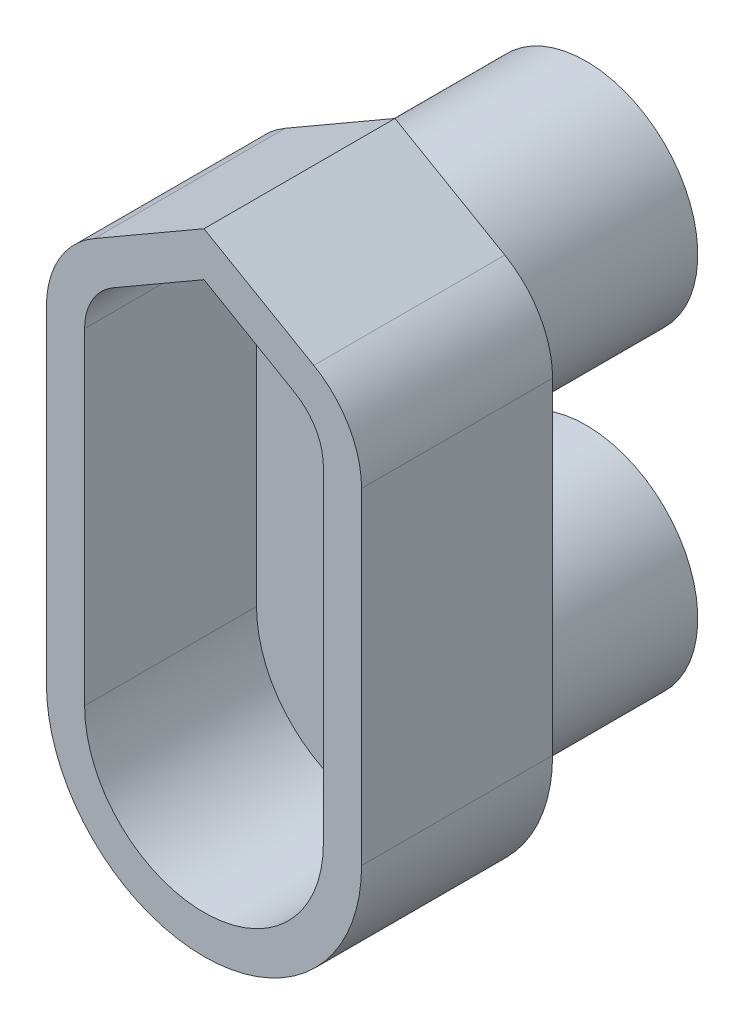
ISO-10303-21;
HEADER;
FILE_DESCRIPTION(('STEP AP214'),'2;1');
FILE_NAME('part.step','',(''),(''),'','','');
FILE_SCHEMA(('AUTOMOTIVE_DESIGN { 1 0 10303 214 1 1 1 1 }'));
ENDSEC;
DATA;
#1=APPLICATION_CONTEXT('core data for automotive mechanical design processes');
#2=APPLICATION_PROTOCOL_DEFINITION('international standard','automotive_design',2000,#1);
#3=PRODUCT_CONTEXT('',#1,'mechanical');
#4=PRODUCT('Part','Part','',(#3));
#5=PRODUCT_RELATED_PRODUCT_CATEGORY('part','',(#4));
#6=PRODUCT_DEFINITION_FORMATION('','',#4);
#7=PRODUCT_DEFINITION_CONTEXT('part definition',#1,'design');
#8=PRODUCT_DEFINITION('design','',#6,#7);
#9=PRODUCT_DEFINITION_SHAPE('','',#8);
#10=(LENGTH_UNIT() NAMED_UNIT(*) SI_UNIT(.MILLI.,.METRE.));
#11=(NAMED_UNIT(*) PLANE_ANGLE_UNIT() SI_UNIT($,.RADIAN.));
#12=(NAMED_UNIT(*) SI_UNIT($,.STERADIAN.) SOLID_ANGLE_UNIT());
#13=UNCERTAINTY_MEASURE_WITH_UNIT(LENGTH_MEASURE(1.E-05),#10,'distance_accuracy_value','');
#14=(GEOMETRIC_REPRESENTATION_CONTEXT(3) GLOBAL_UNCERTAINTY_ASSIGNED_CONTEXT((#13)) GLOBAL_UNIT_ASSIGNED_CONTEXT((#10,
#11,#12)) REPRESENTATION_CONTEXT('',''));
#15=CARTESIAN_POINT('',(0.,0.,0.));
#16=DIRECTION('',(0.,0.,1.));
#17=DIRECTION('',(1.,0.,0.));
#18=AXIS2_PLACEMENT_3D('',#15,#16,#17);
#19=CARTESIAN_POINT('',(-26.8644378136444,165.,20.));
#20=DIRECTION('',(1.,0.,0.));
#21=DIRECTION('',(0.,1.,0.));
#22=AXIS2_PLACEMENT_3D('',#19,#20,#21);
#23=PLANE('',#22);
#24=DIRECTION('',(0.,-1.,0.));
#25=VECTOR('',#24,1.);
#26=CARTESIAN_POINT('',(-26.8644378136444,165.,20.));
#27=LINE('',#26,#25);
#28=CARTESIAN_POINT('',(-26.8644378136444,157.350108933237,20.));
#29=VERTEX_POINT('',#28);
#30=CARTESIAN_POINT('',(-26.8644378136444,140.25,20.));
#31=VERTEX_POINT('',#30);
#32=EDGE_CURVE('E302',#29,#31,#27,.T.);
#33=ORIENTED_EDGE('',*,*,#32,.F.);
#34=DIRECTION('',(0.,0.,1.));
#35=VECTOR('',#34,1.);
#36=CARTESIAN_POINT('',(-26.8644378136444,157.350108933237,10.));
#37=LINE('',#36,#35);
#38=CARTESIAN_POINT('',(-26.8644378136444,157.350108933237,10.));
#39=VERTEX_POINT('',#38);
#40=EDGE_CURVE('E358',#29,#39,#37,.F.);
#41=ORIENTED_EDGE('',*,*,#40,.T.);
#42=DIRECTION('',(0.,1.,0.));
#43=VECTOR('',#42,1.);
#44=CARTESIAN_POINT('',(-26.8644378136444,0.,10.));
#45=LINE('',#44,#43);
#46=CARTESIAN_POINT('',(-26.8644378136444,140.25,10.));
#47=VERTEX_POINT('',#46);
#48=EDGE_CURVE('E264',#47,#39,#45,.T.);
#49=ORIENTED_EDGE('',*,*,#48,.F.);
#50=DIRECTION('',(0.,0.,-1.));
#51=VECTOR('',#50,1.);
#52=CARTESIAN_POINT('',(-26.8644378136444,140.25,20.));
#53=LINE('',#52,#51);
#54=EDGE_CURVE('E310',#47,#31,#53,.F.);
#55=ORIENTED_EDGE('',*,*,#54,.T.);
#56=EDGE_LOOP('',(#33,#41,#49,#55));
#57=FACE_BOUND('',#56,.T.);
#58=ADVANCED_FACE('F71',(#57),#23,.F.);
#59=CARTESIAN_POINT('',(-10.3644378136444,165.,20.));
#60=DIRECTION('',(-1.,0.,0.));
#61=DIRECTION('',(0.,-1.,0.));
#62=AXIS2_PLACEMENT_3D('',#59,#60,#61);
#63=PLANE('',#62);
#64=DIRECTION('',(0.,-1.,0.));
#65=VECTOR('',#64,1.);
#66=CARTESIAN_POINT('',(-10.3644378136444,0.,10.));
#67=LINE('',#66,#65);
#68=CARTESIAN_POINT('',(-10.3644378136444,157.350108933237,10.));
#69=VERTEX_POINT('',#68);
#70=CARTESIAN_POINT('',(-10.3644378136444,140.25,10.));
#71=VERTEX_POINT('',#70);
#72=EDGE_CURVE('E267',#69,#71,#67,.T.);
#73=ORIENTED_EDGE('',*,*,#72,.F.);
#74=DIRECTION('',(0.,0.,-1.));
#75=VECTOR('',#74,1.);
#76=CARTESIAN_POINT('',(-10.3644378136444,157.350108933237,20.));
#77=LINE('',#76,#75);
#78=CARTESIAN_POINT('',(-10.3644378136444,157.350108933237,20.));
#79=VERTEX_POINT('',#78);
#80=EDGE_CURVE('E340',#69,#79,#77,.F.);
#81=ORIENTED_EDGE('',*,*,#80,.T.);
#82=DIRECTION('',(0.,1.,0.));
#83=VECTOR('',#82,1.);
#84=CARTESIAN_POINT('',(-10.3644378136444,165.,20.));
#85=LINE('',#84,#83);
#86=CARTESIAN_POINT('',(-10.3644378136444,140.25,20.));
#87=VERTEX_POINT('',#86);
#88=EDGE_CURVE('E305',#87,#79,#85,.T.);
#89=ORIENTED_EDGE('',*,*,#88,.F.);
#90=DIRECTION('',(0.,0.,-1.));
#91=VECTOR('',#90,1.);
#92=CARTESIAN_POINT('',(-10.3644378136444,140.25,20.));
#93=LINE('',#92,#91);
#94=EDGE_CURVE('E321',#87,#71,#93,.T.);
#95=ORIENTED_EDGE('',*,*,#94,.T.);
#96=EDGE_LOOP('',(#73,#81,#89,#95));
#97=FACE_BOUND('',#96,.T.);
#98=ADVANCED_FACE('F384',(#97),#63,.F.);
#99=CARTESIAN_POINT('',(-18.6144378136444,140.25,20.));
#100=DIRECTION('',(0.,0.,-1.));
#101=DIRECTION('',(-1.,0.,0.));
#102=AXIS2_PLACEMENT_3D('',#99,#100,#101);
#103=CYLINDRICAL_SURFACE('',#102,8.25);
#104=DIRECTION('',(0.,0.,-1.));
#105=VECTOR('',#104,1.);
#106=CARTESIAN_POINT('',(-18.6144378136444,132.,20.));
#107=LINE('',#106,#105);
#108=CARTESIAN_POINT('',(-18.6144378136444,132.,10.));
#109=VERTEX_POINT('',#108);
#110=CARTESIAN_POINT('',(-18.6144378136444,132.,20.));
#111=VERTEX_POINT('',#110);
#112=EDGE_CURVE('E306',#109,#111,#107,.F.);
#113=ORIENTED_EDGE('',*,*,#112,.F.);
#114=CARTESIAN_POINT('',(-18.6144378136444,140.25,10.));
#115=DIRECTION('',(0.,0.,-1.));
#116=DIRECTION('',(-1.,0.,0.));
#117=AXIS2_PLACEMENT_3D('',#114,#115,#116);
#118=CIRCLE('',#117,8.25);
#119=EDGE_CURVE('E272',#71,#109,#118,.T.);
#120=ORIENTED_EDGE('',*,*,#119,.F.);
#121=ORIENTED_EDGE('',*,*,#94,.F.);
#122=CARTESIAN_POINT('',(-18.6144378136444,140.25,20.));
#123=DIRECTION('',(0.,0.,1.));
#124=DIRECTION('',(1.,0.,0.));
#125=AXIS2_PLACEMENT_3D('',#122,#123,#124);
#126=CIRCLE('',#125,8.25);
#127=EDGE_CURVE('E314',#111,#87,#126,.T.);
#128=ORIENTED_EDGE('',*,*,#127,.F.);
#129=EDGE_LOOP('',(#113,#120,#121,#128));
#130=FACE_BOUND('',#129,.T.);
#131=ADVANCED_FACE('F390',(#130),#103,.T.);
#132=CARTESIAN_POINT('',(-18.6144378136444,140.25,20.));
#133=DIRECTION('',(0.,0.,-1.));
#134=DIRECTION('',(-1.,0.,0.));
#135=AXIS2_PLACEMENT_3D('',#132,#133,#134);
#136=CYLINDRICAL_SURFACE('',#135,8.25);
#137=ORIENTED_EDGE('',*,*,#54,.F.);
#138=EDGE_CURVE('E271',#109,#47,#118,.T.);
#139=ORIENTED_EDGE('',*,*,#138,.F.);
#140=ORIENTED_EDGE('',*,*,#112,.T.);
#141=CARTESIAN_POINT('',(-18.6144378136444,140.25,20.));
#142=DIRECTION('',(0.,0.,1.));
#143=DIRECTION('',(1.,0.,0.));
#144=AXIS2_PLACEMENT_3D('',#141,#142,#143);
#145=CIRCLE('',#144,8.25);
#146=EDGE_CURVE('E317',#31,#111,#145,.T.);
#147=ORIENTED_EDGE('',*,*,#146,.F.);
#148=EDGE_LOOP('',(#137,#139,#140,#147));
#149=FACE_BOUND('',#148,.T.);
#150=ADVANCED_FACE('F396',(#149),#136,.T.);
#151=CARTESIAN_POINT('',(-18.6144378136445,165.,20.));
#152=DIRECTION('',(-0.499999999999997,-0.86602540378444,0.));
#153=DIRECTION('',(0.,0.,-1.));
#154=AXIS2_PLACEMENT_3D('',#151,#152,#153);
#155=PLANE('',#154);
#156=DIRECTION('',(0.86602540378444,-0.499999999999997,0.));
#157=VECTOR('',#156,1.);
#158=CARTESIAN_POINT('',(66.7934863588049,115.68971198811,20.));
#159=LINE('',#158,#157);
#160=CARTESIAN_POINT('',(-12.8644378136445,161.68023595216,20.));
#161=VERTEX_POINT('',#160);
#162=CARTESIAN_POINT('',(-18.6144378136445,165.,20.));
#163=VERTEX_POINT('',#162);
#164=EDGE_CURVE('E325',#161,#163,#159,.F.);
#165=ORIENTED_EDGE('',*,*,#164,.F.);
#166=DIRECTION('',(0.,0.,1.));
#167=VECTOR('',#166,1.);
#168=CARTESIAN_POINT('',(-12.8644378136445,161.68023595216,10.));
#169=LINE('',#168,#167);
#170=CARTESIAN_POINT('',(-12.8644378136444,161.68023595216,10.));
#171=VERTEX_POINT('',#170);
#172=EDGE_CURVE('E350',#161,#171,#169,.F.);
#173=ORIENTED_EDGE('',*,*,#172,.T.);
#174=DIRECTION('',(0.86602540378444,-0.499999999999997,0.));
#175=VECTOR('',#174,1.);
#176=CARTESIAN_POINT('',(-18.6144378136445,165.,10.));
#177=LINE('',#176,#175);
#178=CARTESIAN_POINT('',(-18.6144378136444,165.,10.));
#179=VERTEX_POINT('',#178);
#180=EDGE_CURVE('E298',#171,#179,#177,.F.);
#181=ORIENTED_EDGE('',*,*,#180,.T.);
#182=DIRECTION('',(0.,0.,-1.));
#183=VECTOR('',#182,1.);
#184=CARTESIAN_POINT('',(-18.6144378136445,165.,20.));
#185=LINE('',#184,#183);
#186=EDGE_CURVE('E301',#163,#179,#185,.T.);
#187=ORIENTED_EDGE('',*,*,#186,.F.);
#188=EDGE_LOOP('',(#165,#173,#181,#187));
#189=FACE_BOUND('',#188,.T.);
#190=ADVANCED_FACE('F399',(#189),#155,.F.);
#191=CARTESIAN_POINT('',(-26.8644378136444,160.236860279186,20.));
#192=DIRECTION('',(0.499999999999997,-0.86602540378444,0.));
#193=DIRECTION('',(0.,0.,-1.));
#194=AXIS2_PLACEMENT_3D('',#191,#192,#193);
#195=PLANE('',#194);
#196=DIRECTION('',(0.86602540378444,0.499999999999997,0.));
#197=VECTOR('',#196,1.);
#198=CARTESIAN_POINT('',(-26.8644378136444,160.236860279186,10.));
#199=LINE('',#198,#197);
#200=CARTESIAN_POINT('',(-24.3644378136444,161.68023595216,10.));
#201=VERTEX_POINT('',#200);
#202=EDGE_CURVE('E334',#179,#201,#199,.F.);
#203=ORIENTED_EDGE('',*,*,#202,.T.);
#204=DIRECTION('',(0.,0.,-1.));
#205=VECTOR('',#204,1.);
#206=CARTESIAN_POINT('',(-24.3644378136444,161.68023595216,20.));
#207=LINE('',#206,#205);
#208=CARTESIAN_POINT('',(-24.3644378136444,161.68023595216,20.));
#209=VERTEX_POINT('',#208);
#210=EDGE_CURVE('E80',#201,#209,#207,.F.);
#211=ORIENTED_EDGE('',*,*,#210,.T.);
#212=DIRECTION('',(0.86602540378444,0.499999999999997,0.));
#213=VECTOR('',#212,1.);
#214=CARTESIAN_POINT('',(-76.100705265627,131.810288011891,20.));
#215=LINE('',#214,#213);
#216=EDGE_CURVE('E330',#163,#209,#215,.F.);
#217=ORIENTED_EDGE('',*,*,#216,.F.);
#218=ORIENTED_EDGE('',*,*,#186,.T.);
#219=EDGE_LOOP('',(#203,#211,#217,#218));
#220=FACE_BOUND('',#219,.T.);
#221=ADVANCED_FACE('F405',(#220),#195,.F.);
#222=CARTESIAN_POINT('',(0.,0.,20.));
#223=DIRECTION('',(0.,0.,1.));
#224=DIRECTION('',(1.,0.,0.));
#225=AXIS2_PLACEMENT_3D('',#222,#223,#224);
#226=PLANE('',#225);
#227=CARTESIAN_POINT('',(-18.6144378136444,140.25,20.));
#228=DIRECTION('',(0.,0.,1.));
#229=DIRECTION('',(1.,0.,0.));
#230=AXIS2_PLACEMENT_3D('',#227,#228,#229);
#231=CIRCLE('',#230,6.25);
#232=CARTESIAN_POINT('',(-24.8644378136444,140.25,20.));
#233=VERTEX_POINT('',#232);
#234=CARTESIAN_POINT('',(-12.3644378136444,140.25,20.));
#235=VERTEX_POINT('',#234);
#236=EDGE_CURVE('E184',#233,#235,#231,.T.);
#237=ORIENTED_EDGE('',*,*,#236,.F.);
#238=DIRECTION('',(0.,-1.,0.));
#239=VECTOR('',#238,1.);
#240=CARTESIAN_POINT('',(-24.8644378136444,157.350108933237,20.));
#241=LINE('',#240,#239);
#242=CARTESIAN_POINT('',(-24.8644378136445,157.350108933237,20.));
#243=VERTEX_POINT('',#242);
#244=EDGE_CURVE('E206',#243,#233,#241,.T.);
#245=ORIENTED_EDGE('',*,*,#244,.F.);
#246=CARTESIAN_POINT('',(-21.8644378136444,157.350108933237,20.));
#247=DIRECTION('',(0.,0.,1.));
#248=DIRECTION('',(1.,0.,0.));
#249=AXIS2_PLACEMENT_3D('',#246,#247,#248);
#250=CIRCLE('',#249,3.00000000000002);
#251=CARTESIAN_POINT('',(-23.3644378136444,159.948185144591,20.));
#252=VERTEX_POINT('',#251);
#253=EDGE_CURVE('E239',#252,#243,#250,.T.);
#254=ORIENTED_EDGE('',*,*,#253,.F.);
#255=DIRECTION('',(-0.866025403784438,-0.500000000000001,0.));
#256=VECTOR('',#255,1.);
#257=CARTESIAN_POINT('',(-18.6144378136445,162.690598923242,20.));
#258=LINE('',#257,#256);
#259=CARTESIAN_POINT('',(-18.6144378136445,162.690598923242,20.));
#260=VERTEX_POINT('',#259);
#261=EDGE_CURVE('E235',#260,#252,#258,.T.);
#262=ORIENTED_EDGE('',*,*,#261,.F.);
#263=DIRECTION('',(-0.866025403784441,0.499999999999995,0.));
#264=VECTOR('',#263,1.);
#265=CARTESIAN_POINT('',(-13.8644378136445,159.948185144591,20.));
#266=LINE('',#265,#264);
#267=CARTESIAN_POINT('',(-13.8644378136445,159.948185144591,20.));
#268=VERTEX_POINT('',#267);
#269=EDGE_CURVE('E231',#268,#260,#266,.T.);
#270=ORIENTED_EDGE('',*,*,#269,.F.);
#271=CARTESIAN_POINT('',(-15.3644378136444,157.350108933237,20.));
#272=DIRECTION('',(0.,0.,1.));
#273=DIRECTION('',(1.,0.,0.));
#274=AXIS2_PLACEMENT_3D('',#271,#272,#273);
#275=CIRCLE('',#274,3.);
#276=CARTESIAN_POINT('',(-12.3644378136444,157.350108933237,20.));
#277=VERTEX_POINT('',#276);
#278=EDGE_CURVE('E227',#277,#268,#275,.T.);
#279=ORIENTED_EDGE('',*,*,#278,.F.);
#280=DIRECTION('',(0.,1.,0.));
#281=VECTOR('',#280,1.);
#282=CARTESIAN_POINT('',(-12.3644378136444,140.25,20.));
#283=LINE('',#282,#281);
#284=EDGE_CURVE('E224',#235,#277,#283,.T.);
#285=ORIENTED_EDGE('',*,*,#284,.F.);
#286=EDGE_LOOP('',(#237,#245,#254,#262,#270,#279,#285));
#287=FACE_BOUND('',#286,.T.);
#288=ORIENTED_EDGE('',*,*,#88,.T.);
#289=CARTESIAN_POINT('',(-15.3644378136444,157.350108933237,20.));
#290=DIRECTION('',(0.,0.,1.));
#291=DIRECTION('',(1.,0.,0.));
#292=AXIS2_PLACEMENT_3D('',#289,#290,#291);
#293=CIRCLE('',#292,5.);
#294=EDGE_CURVE('E347',#79,#161,#293,.T.);
#295=ORIENTED_EDGE('',*,*,#294,.T.);
#296=ORIENTED_EDGE('',*,*,#164,.T.);
#297=ORIENTED_EDGE('',*,*,#216,.T.);
#298=CARTESIAN_POINT('',(-21.8644378136444,157.350108933237,20.));
#299=DIRECTION('',(0.,0.,1.));
#300=DIRECTION('',(1.,0.,0.));
#301=AXIS2_PLACEMENT_3D('',#298,#299,#300);
#302=CIRCLE('',#301,5.);
#303=EDGE_CURVE('E344',#209,#29,#302,.T.);
#304=ORIENTED_EDGE('',*,*,#303,.T.);
#305=ORIENTED_EDGE('',*,*,#32,.T.);
#306=ORIENTED_EDGE('',*,*,#146,.T.);
#307=ORIENTED_EDGE('',*,*,#127,.T.);
#308=EDGE_LOOP('',(#288,#295,#296,#297,#304,#305,#306,#307));
#309=FACE_BOUND('',#308,.T.);
#310=ADVANCED_FACE('F411',(#287,#309),#226,.T.);
#311=CARTESIAN_POINT('',(-18.6144378136445,140.25,10.));
#312=DIRECTION('',(0.,0.,-1.));
#313=DIRECTION('',(-1.,0.,0.));
#314=AXIS2_PLACEMENT_3D('',#311,#312,#313);
#315=CYLINDRICAL_SURFACE('',#314,5.84999999999999);
#316=CARTESIAN_POINT('',(-18.6144378136445,140.25,10.));
#317=DIRECTION('',(0.,0.,-1.));
#318=DIRECTION('',(-1.,0.,0.));
#319=AXIS2_PLACEMENT_3D('',#316,#317,#318);
#320=CIRCLE('',#319,5.84999999999999);
#321=CARTESIAN_POINT('',(-24.4644378136445,140.25,10.));
#322=VERTEX_POINT('',#321);
#323=EDGE_CURVE('E275',#322,#322,#320,.F.);
#324=ORIENTED_EDGE('',*,*,#323,.F.);
#325=EDGE_LOOP('',(#324));
#326=FACE_BOUND('',#325,.T.);
#327=CARTESIAN_POINT('',(-18.6144378136445,140.25,0.));
#328=DIRECTION('',(0.,0.,-1.));
#329=DIRECTION('',(-1.,0.,0.));
#330=AXIS2_PLACEMENT_3D('',#327,#328,#329);
#331=CIRCLE('',#330,5.84999999999999);
#332=CARTESIAN_POINT('',(-24.4644378136445,140.25,0.));
#333=VERTEX_POINT('',#332);
#334=EDGE_CURVE('E284',#333,#333,#331,.F.);
#335=ORIENTED_EDGE('',*,*,#334,.T.);
#336=EDGE_LOOP('',(#335));
#337=FACE_BOUND('',#336,.T.);
#338=ADVANCED_FACE('F451',(#326,#337),#315,.T.);
#339=CARTESIAN_POINT('',(-18.6144378136445,156.75,10.));
#340=DIRECTION('',(0.,0.,-1.));
#341=DIRECTION('',(-1.,0.,0.));
#342=AXIS2_PLACEMENT_3D('',#339,#340,#341);
#343=CYLINDRICAL_SURFACE('',#342,5.84999999999999);
#344=CARTESIAN_POINT('',(-18.6144378136445,156.75,10.));
#345=DIRECTION('',(0.,0.,-1.));
#346=DIRECTION('',(-1.,0.,0.));
#347=AXIS2_PLACEMENT_3D('',#344,#345,#346);
#348=CIRCLE('',#347,5.84999999999999);
#349=CARTESIAN_POINT('',(-24.4644378136445,156.75,10.));
#350=VERTEX_POINT('',#349);
#351=EDGE_CURVE('E279',#350,#350,#348,.T.);
#352=ORIENTED_EDGE('',*,*,#351,.T.);
#353=EDGE_LOOP('',(#352));
#354=FACE_BOUND('',#353,.T.);
#355=CARTESIAN_POINT('',(-18.6144378136445,156.75,0.));
#356=DIRECTION('',(0.,0.,-1.));
#357=DIRECTION('',(-1.,0.,0.));
#358=AXIS2_PLACEMENT_3D('',#355,#356,#357);
#359=CIRCLE('',#358,5.84999999999999);
#360=CARTESIAN_POINT('',(-24.4644378136445,156.75,0.));
#361=VERTEX_POINT('',#360);
#362=EDGE_CURVE('E268',#361,#361,#359,.T.);
#363=ORIENTED_EDGE('',*,*,#362,.F.);
#364=EDGE_LOOP('',(#363));
#365=FACE_BOUND('',#364,.T.);
#366=ADVANCED_FACE('F457',(#354,#365),#343,.T.);
#367=CARTESIAN_POINT('',(0.,0.,10.));
#368=DIRECTION('',(0.,0.,-1.));
#369=DIRECTION('',(-1.,0.,0.));
#370=AXIS2_PLACEMENT_3D('',#367,#368,#369);
#371=PLANE('',#370);
#372=ORIENTED_EDGE('',*,*,#180,.F.);
#373=CARTESIAN_POINT('',(-15.3644378136444,157.350108933237,10.));
#374=DIRECTION('',(0.,0.,-1.));
#375=DIRECTION('',(-1.,0.,0.));
#376=AXIS2_PLACEMENT_3D('',#373,#374,#375);
#377=CIRCLE('',#376,5.);
#378=EDGE_CURVE('E355',#171,#69,#377,.T.);
#379=ORIENTED_EDGE('',*,*,#378,.T.);
#380=ORIENTED_EDGE('',*,*,#72,.T.);
#381=ORIENTED_EDGE('',*,*,#119,.T.);
#382=ORIENTED_EDGE('',*,*,#138,.T.);
#383=ORIENTED_EDGE('',*,*,#48,.T.);
#384=CARTESIAN_POINT('',(-21.8644378136444,157.350108933237,10.));
#385=DIRECTION('',(0.,0.,-1.));
#386=DIRECTION('',(-1.,0.,0.));
#387=AXIS2_PLACEMENT_3D('',#384,#385,#386);
#388=CIRCLE('',#387,5.);
#389=EDGE_CURVE('E95',#39,#201,#388,.T.);
#390=ORIENTED_EDGE('',*,*,#389,.T.);
#391=ORIENTED_EDGE('',*,*,#202,.F.);
#392=EDGE_LOOP('',(#372,#379,#380,#381,#382,#383,#390,#391));
#393=FACE_BOUND('',#392,.T.);
#394=ORIENTED_EDGE('',*,*,#323,.T.);
#395=EDGE_LOOP('',(#394));
#396=FACE_BOUND('',#395,.T.);
#397=ORIENTED_EDGE('',*,*,#351,.F.);
#398=EDGE_LOOP('',(#397));
#399=FACE_BOUND('',#398,.T.);
#400=ADVANCED_FACE('F431',(#393,#396,#399),#371,.T.);
#401=CARTESIAN_POINT('',(0.,0.,0.));
#402=DIRECTION('',(0.,0.,1.));
#403=DIRECTION('',(1.,0.,0.));
#404=AXIS2_PLACEMENT_3D('',#401,#402,#403);
#405=PLANE('',#404);
#406=CARTESIAN_POINT('',(-18.6144378136445,156.75,0.));
#407=DIRECTION('',(0.,0.,-1.));
#408=DIRECTION('',(-1.,0.,0.));
#409=AXIS2_PLACEMENT_3D('',#406,#407,#408);
#410=CIRCLE('',#409,5.05);
#411=CARTESIAN_POINT('',(-23.6644378136445,156.75,0.));
#412=VERTEX_POINT('',#411);
#413=EDGE_CURVE('E294',#412,#412,#410,.T.);
#414=ORIENTED_EDGE('',*,*,#413,.F.);
#415=EDGE_LOOP('',(#414));
#416=FACE_BOUND('',#415,.T.);
#417=ORIENTED_EDGE('',*,*,#362,.T.);
#418=EDGE_LOOP('',(#417));
#419=FACE_BOUND('',#418,.T.);
#420=ADVANCED_FACE('F463',(#416,#419),#405,.F.);
#421=CARTESIAN_POINT('',(-18.6144378136445,156.75,10.));
#422=DIRECTION('',(0.,0.,-1.));
#423=DIRECTION('',(-1.,0.,0.));
#424=AXIS2_PLACEMENT_3D('',#421,#422,#423);
#425=CYLINDRICAL_SURFACE('',#424,5.05);
#426=CARTESIAN_POINT('',(-18.6144378136445,156.75,2.7));
#427=DIRECTION('',(0.,0.,-1.));
#428=DIRECTION('',(-1.,0.,0.));
#429=AXIS2_PLACEMENT_3D('',#426,#427,#428);
#430=CIRCLE('',#429,5.05);
#431=CARTESIAN_POINT('',(-23.6644378136445,156.75,2.7));
#432=VERTEX_POINT('',#431);
#433=EDGE_CURVE('E249',#432,#432,#430,.F.);
#434=ORIENTED_EDGE('',*,*,#433,.T.);
#435=EDGE_LOOP('',(#434));
#436=FACE_BOUND('',#435,.T.);
#437=ORIENTED_EDGE('',*,*,#413,.T.);
#438=EDGE_LOOP('',(#437));
#439=FACE_BOUND('',#438,.T.);
#440=ADVANCED_FACE('F367',(#436,#439),#425,.F.);
#441=ORIENTED_EDGE('',*,*,#334,.F.);
#442=EDGE_LOOP('',(#441));
#443=FACE_BOUND('',#442,.T.);
#444=CARTESIAN_POINT('',(-18.6144378136445,140.25,0.));
#445=DIRECTION('',(0.,0.,-1.));
#446=DIRECTION('',(-1.,0.,0.));
#447=AXIS2_PLACEMENT_3D('',#444,#445,#446);
#448=CIRCLE('',#447,5.05);
#449=CARTESIAN_POINT('',(-23.6644378136445,140.25,0.));
#450=VERTEX_POINT('',#449);
#451=EDGE_CURVE('E283',#450,#450,#448,.F.);
#452=ORIENTED_EDGE('',*,*,#451,.T.);
#453=EDGE_LOOP('',(#452));
#454=FACE_BOUND('',#453,.T.);
#455=ADVANCED_FACE('F423',(#443,#454),#405,.F.);
#456=CARTESIAN_POINT('',(-18.6144378136445,140.25,10.));
#457=DIRECTION('',(0.,0.,-1.));
#458=DIRECTION('',(-1.,0.,0.));
#459=AXIS2_PLACEMENT_3D('',#456,#457,#458);
#460=CYLINDRICAL_SURFACE('',#459,5.05);
#461=CARTESIAN_POINT('',(-18.6144378136445,140.25,2.7));
#462=DIRECTION('',(0.,0.,-1.));
#463=DIRECTION('',(-1.,0.,0.));
#464=AXIS2_PLACEMENT_3D('',#461,#462,#463);
#465=CIRCLE('',#464,5.05);
#466=CARTESIAN_POINT('',(-23.6644378136445,140.25,2.7));
#467=VERTEX_POINT('',#466);
#468=EDGE_CURVE('E12',#467,#467,#465,.T.);
#469=ORIENTED_EDGE('',*,*,#468,.F.);
#470=EDGE_LOOP('',(#469));
#471=FACE_BOUND('',#470,.T.);
#472=ORIENTED_EDGE('',*,*,#451,.F.);
#473=EDGE_LOOP('',(#472));
#474=FACE_BOUND('',#473,.T.);
#475=ADVANCED_FACE('F418',(#471,#474),#460,.F.);
#476=CARTESIAN_POINT('',(-15.3644378136444,157.350108933237,20.));
#477=DIRECTION('',(0.,0.,1.));
#478=DIRECTION('',(1.,0.,0.));
#479=AXIS2_PLACEMENT_3D('',#476,#477,#478);
#480=CYLINDRICAL_SURFACE('',#479,5.);
#481=ORIENTED_EDGE('',*,*,#378,.F.);
#482=ORIENTED_EDGE('',*,*,#172,.F.);
#483=ORIENTED_EDGE('',*,*,#294,.F.);
#484=ORIENTED_EDGE('',*,*,#80,.F.);
#485=EDGE_LOOP('',(#481,#482,#483,#484));
#486=FACE_BOUND('',#485,.T.);
#487=ADVANCED_FACE('F380',(#486),#480,.T.);
#488=CARTESIAN_POINT('',(-21.8644378136444,157.350108933237,20.));
#489=DIRECTION('',(0.,0.,-1.));
#490=DIRECTION('',(-1.,0.,0.));
#491=AXIS2_PLACEMENT_3D('',#488,#489,#490);
#492=CYLINDRICAL_SURFACE('',#491,5.);
#493=ORIENTED_EDGE('',*,*,#303,.F.);
#494=ORIENTED_EDGE('',*,*,#210,.F.);
#495=ORIENTED_EDGE('',*,*,#389,.F.);
#496=ORIENTED_EDGE('',*,*,#40,.F.);
#497=EDGE_LOOP('',(#493,#494,#495,#496));
#498=FACE_BOUND('',#497,.T.);
#499=ADVANCED_FACE('F73',(#498),#492,.T.);
#500=CARTESIAN_POINT('',(-18.6144378136445,156.75,2.7));
#501=DIRECTION('',(0.,0.,-1.));
#502=DIRECTION('',(-1.,0.,0.));
#503=AXIS2_PLACEMENT_3D('',#500,#501,#502);
#504=PLANE('',#503);
#505=ORIENTED_EDGE('',*,*,#433,.F.);
#506=EDGE_LOOP('',(#505));
#507=FACE_BOUND('',#506,.T.);
#508=ADVANCED_FACE('F370',(#507),#504,.T.);
#509=CARTESIAN_POINT('',(-18.6144378136445,140.25,2.7));
#510=DIRECTION('',(0.,0.,-1.));
#511=DIRECTION('',(-1.,0.,0.));
#512=AXIS2_PLACEMENT_3D('',#509,#510,#511);
#513=PLANE('',#512);
#514=ORIENTED_EDGE('',*,*,#468,.T.);
#515=EDGE_LOOP('',(#514));
#516=FACE_BOUND('',#515,.T.);
#517=ADVANCED_FACE('F372',(#516),#513,.T.);
#518=CARTESIAN_POINT('',(-18.6144378136444,140.25,11.));
#519=DIRECTION('',(0.,0.,1.));
#520=DIRECTION('',(1.,0.,0.));
#521=AXIS2_PLACEMENT_3D('',#518,#519,#520);
#522=CYLINDRICAL_SURFACE('',#521,6.25);
#523=ORIENTED_EDGE('',*,*,#236,.T.);
#524=DIRECTION('',(0.,0.,1.));
#525=VECTOR('',#524,1.);
#526=CARTESIAN_POINT('',(-12.3644378136444,140.25,11.));
#527=LINE('',#526,#525);
#528=CARTESIAN_POINT('',(-12.3644378136444,140.25,11.));
#529=VERTEX_POINT('',#528);
#530=EDGE_CURVE('E87',#529,#235,#527,.T.);
#531=ORIENTED_EDGE('',*,*,#530,.F.);
#532=CARTESIAN_POINT('',(-18.6144378136444,140.25,11.));
#533=DIRECTION('',(0.,0.,1.));
#534=DIRECTION('',(1.,0.,0.));
#535=AXIS2_PLACEMENT_3D('',#532,#533,#534);
#536=CIRCLE('',#535,6.25);
#537=CARTESIAN_POINT('',(-24.8644378136444,140.25,11.));
#538=VERTEX_POINT('',#537);
#539=EDGE_CURVE('E181',#538,#529,#536,.T.);
#540=ORIENTED_EDGE('',*,*,#539,.F.);
#541=DIRECTION('',(0.,0.,1.));
#542=VECTOR('',#541,1.);
#543=CARTESIAN_POINT('',(-24.8644378136444,140.25,11.));
#544=LINE('',#543,#542);
#545=EDGE_CURVE('E246',#538,#233,#544,.T.);
#546=ORIENTED_EDGE('',*,*,#545,.T.);
#547=EDGE_LOOP('',(#523,#531,#540,#546));
#548=FACE_BOUND('',#547,.T.);
#549=ADVANCED_FACE('F179',(#548),#522,.F.);
#550=CARTESIAN_POINT('',(-24.8644378136444,157.350108933237,11.));
#551=DIRECTION('',(-1.,0.,0.));
#552=DIRECTION('',(0.,-1.,0.));
#553=AXIS2_PLACEMENT_3D('',#550,#551,#552);
#554=PLANE('',#553);
#555=ORIENTED_EDGE('',*,*,#244,.T.);
#556=ORIENTED_EDGE('',*,*,#545,.F.);
#557=DIRECTION('',(0.,-1.,0.));
#558=VECTOR('',#557,1.);
#559=CARTESIAN_POINT('',(-24.8644378136444,157.350108933237,11.));
#560=LINE('',#559,#558);
#561=CARTESIAN_POINT('',(-24.8644378136445,157.350108933237,11.));
#562=VERTEX_POINT('',#561);
#563=EDGE_CURVE('E188',#562,#538,#560,.T.);
#564=ORIENTED_EDGE('',*,*,#563,.F.);
#565=DIRECTION('',(0.,0.,1.));
#566=VECTOR('',#565,1.);
#567=CARTESIAN_POINT('',(-24.8644378136445,157.350108933237,11.));
#568=LINE('',#567,#566);
#569=EDGE_CURVE('E250',#562,#243,#568,.T.);
#570=ORIENTED_EDGE('',*,*,#569,.T.);
#571=EDGE_LOOP('',(#555,#556,#564,#570));
#572=FACE_BOUND('',#571,.T.);
#573=ADVANCED_FACE('F542',(#572),#554,.F.);
#574=CARTESIAN_POINT('',(-21.8644378136444,157.350108933237,11.));
#575=DIRECTION('',(0.,0.,1.));
#576=DIRECTION('',(1.,0.,0.));
#577=AXIS2_PLACEMENT_3D('',#574,#575,#576);
#578=CYLINDRICAL_SURFACE('',#577,3.00000000000002);
#579=ORIENTED_EDGE('',*,*,#253,.T.);
#580=ORIENTED_EDGE('',*,*,#569,.F.);
#581=CARTESIAN_POINT('',(-21.8644378136444,157.350108933237,11.));
#582=DIRECTION('',(0.,0.,1.));
#583=DIRECTION('',(1.,0.,0.));
#584=AXIS2_PLACEMENT_3D('',#581,#582,#583);
#585=CIRCLE('',#584,3.00000000000002);
#586=CARTESIAN_POINT('',(-23.3644378136444,159.948185144591,11.));
#587=VERTEX_POINT('',#586);
#588=EDGE_CURVE('E219',#587,#562,#585,.T.);
#589=ORIENTED_EDGE('',*,*,#588,.F.);
#590=DIRECTION('',(0.,0.,1.));
#591=VECTOR('',#590,1.);
#592=CARTESIAN_POINT('',(-23.3644378136444,159.948185144591,11.));
#593=LINE('',#592,#591);
#594=EDGE_CURVE('E253',#587,#252,#593,.T.);
#595=ORIENTED_EDGE('',*,*,#594,.T.);
#596=EDGE_LOOP('',(#579,#580,#589,#595));
#597=FACE_BOUND('',#596,.T.);
#598=ADVANCED_FACE('F551',(#597),#578,.F.);
#599=CARTESIAN_POINT('',(-18.6144378136445,162.690598923242,11.));
#600=DIRECTION('',(-0.500000000000001,0.866025403784438,0.));
#601=DIRECTION('',(-0.866025403784438,-0.500000000000001,0.));
#602=AXIS2_PLACEMENT_3D('',#599,#600,#601);
#603=PLANE('',#602);
#604=ORIENTED_EDGE('',*,*,#261,.T.);
#605=ORIENTED_EDGE('',*,*,#594,.F.);
#606=DIRECTION('',(-0.866025403784438,-0.500000000000001,0.));
#607=VECTOR('',#606,1.);
#608=CARTESIAN_POINT('',(-18.6144378136445,162.690598923242,11.));
#609=LINE('',#608,#607);
#610=CARTESIAN_POINT('',(-18.6144378136445,162.690598923242,11.));
#611=VERTEX_POINT('',#610);
#612=EDGE_CURVE('E215',#611,#587,#609,.T.);
#613=ORIENTED_EDGE('',*,*,#612,.F.);
#614=DIRECTION('',(0.,0.,1.));
#615=VECTOR('',#614,1.);
#616=CARTESIAN_POINT('',(-18.6144378136445,162.690598923242,11.));
#617=LINE('',#616,#615);
#618=EDGE_CURVE('E256',#611,#260,#617,.T.);
#619=ORIENTED_EDGE('',*,*,#618,.T.);
#620=EDGE_LOOP('',(#604,#605,#613,#619));
#621=FACE_BOUND('',#620,.T.);
#622=ADVANCED_FACE('F561',(#621),#603,.F.);
#623=CARTESIAN_POINT('',(-13.8644378136445,159.948185144591,11.));
#624=DIRECTION('',(0.499999999999995,0.866025403784441,0.));
#625=DIRECTION('',(-0.866025403784441,0.499999999999995,0.));
#626=AXIS2_PLACEMENT_3D('',#623,#624,#625);
#627=PLANE('',#626);
#628=ORIENTED_EDGE('',*,*,#269,.T.);
#629=ORIENTED_EDGE('',*,*,#618,.F.);
#630=DIRECTION('',(-0.866025403784441,0.499999999999995,0.));
#631=VECTOR('',#630,1.);
#632=CARTESIAN_POINT('',(-13.8644378136445,159.948185144591,11.));
#633=LINE('',#632,#631);
#634=CARTESIAN_POINT('',(-13.8644378136445,159.948185144591,11.));
#635=VERTEX_POINT('',#634);
#636=EDGE_CURVE('E211',#635,#611,#633,.T.);
#637=ORIENTED_EDGE('',*,*,#636,.F.);
#638=DIRECTION('',(0.,0.,1.));
#639=VECTOR('',#638,1.);
#640=CARTESIAN_POINT('',(-13.8644378136445,159.948185144591,11.));
#641=LINE('',#640,#639);
#642=EDGE_CURVE('E259',#635,#268,#641,.T.);
#643=ORIENTED_EDGE('',*,*,#642,.T.);
#644=EDGE_LOOP('',(#628,#629,#637,#643));
#645=FACE_BOUND('',#644,.T.);
#646=ADVANCED_FACE('F571',(#645),#627,.F.);
#647=CARTESIAN_POINT('',(-15.3644378136444,157.350108933237,11.));
#648=DIRECTION('',(0.,0.,1.));
#649=DIRECTION('',(1.,0.,0.));
#650=AXIS2_PLACEMENT_3D('',#647,#648,#649);
#651=CYLINDRICAL_SURFACE('',#650,3.);
#652=ORIENTED_EDGE('',*,*,#278,.T.);
#653=ORIENTED_EDGE('',*,*,#642,.F.);
#654=CARTESIAN_POINT('',(-15.3644378136444,157.350108933237,11.));
#655=DIRECTION('',(0.,0.,1.));
#656=DIRECTION('',(1.,0.,0.));
#657=AXIS2_PLACEMENT_3D('',#654,#655,#656);
#658=CIRCLE('',#657,3.);
#659=CARTESIAN_POINT('',(-12.3644378136444,157.350108933237,11.));
#660=VERTEX_POINT('',#659);
#661=EDGE_CURVE('E197',#660,#635,#658,.T.);
#662=ORIENTED_EDGE('',*,*,#661,.F.);
#663=DIRECTION('',(0.,0.,1.));
#664=VECTOR('',#663,1.);
#665=CARTESIAN_POINT('',(-12.3644378136444,157.350108933237,11.));
#666=LINE('',#665,#664);
#667=EDGE_CURVE('E187',#660,#277,#666,.T.);
#668=ORIENTED_EDGE('',*,*,#667,.T.);
#669=EDGE_LOOP('',(#652,#653,#662,#668));
#670=FACE_BOUND('',#669,.T.);
#671=ADVANCED_FACE('F581',(#670),#651,.F.);
#672=CARTESIAN_POINT('',(-12.3644378136444,140.25,11.));
#673=DIRECTION('',(1.,0.,0.));
#674=DIRECTION('',(0.,1.,0.));
#675=AXIS2_PLACEMENT_3D('',#672,#673,#674);
#676=PLANE('',#675);
#677=ORIENTED_EDGE('',*,*,#284,.T.);
#678=ORIENTED_EDGE('',*,*,#667,.F.);
#679=DIRECTION('',(0.,1.,0.));
#680=VECTOR('',#679,1.);
#681=CARTESIAN_POINT('',(-12.3644378136444,140.25,11.));
#682=LINE('',#681,#680);
#683=EDGE_CURVE('E191',#529,#660,#682,.T.);
#684=ORIENTED_EDGE('',*,*,#683,.F.);
#685=ORIENTED_EDGE('',*,*,#530,.T.);
#686=EDGE_LOOP('',(#677,#678,#684,#685));
#687=FACE_BOUND('',#686,.T.);
#688=ADVANCED_FACE('F192',(#687),#676,.F.);
#689=CARTESIAN_POINT('',(-18.6144378136444,140.25,11.));
#690=DIRECTION('',(0.,0.,1.));
#691=DIRECTION('',(1.,0.,0.));
#692=AXIS2_PLACEMENT_3D('',#689,#690,#691);
#693=PLANE('',#692);
#694=ORIENTED_EDGE('',*,*,#539,.T.);
#695=ORIENTED_EDGE('',*,*,#683,.T.);
#696=ORIENTED_EDGE('',*,*,#661,.T.);
#697=ORIENTED_EDGE('',*,*,#636,.T.);
#698=ORIENTED_EDGE('',*,*,#612,.T.);
#699=ORIENTED_EDGE('',*,*,#588,.T.);
#700=ORIENTED_EDGE('',*,*,#563,.T.);
#701=EDGE_LOOP('',(#694,#695,#696,#697,#698,#699,#700));
#702=FACE_BOUND('',#701,.T.);
#703=ADVANCED_FACE('F200',(#702),#693,.T.);
#704=CLOSED_SHELL('',(#58,#98,#131,#150,#190,#221,#310,#338,#366,#400,#420,#440,#455,#475,#487,
#499,#508,#517,#549,#573,#598,#622,#646,#671,#688,#703));
#705=MANIFOLD_SOLID_BREP('B2',#704);
#706=ADVANCED_BREP_SHAPE_REPRESENTATION('',(#18,#705),#14);
#707=SHAPE_DEFINITION_REPRESENTATION(#9,#706);
ENDSEC;
END-ISO-10303-21;
